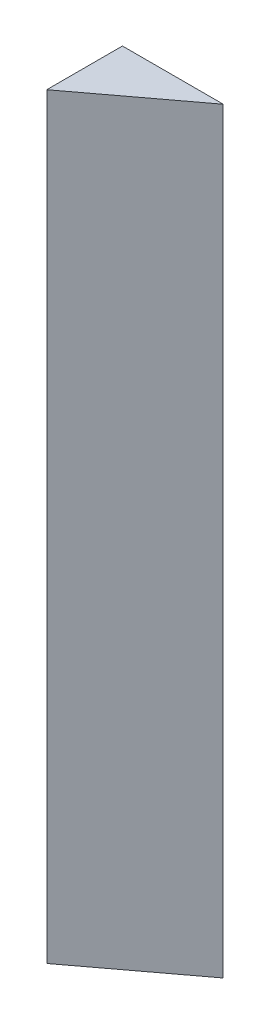
ISO-10303-21;
HEADER;
FILE_DESCRIPTION(('STEP AP214'),'2;1');
FILE_NAME('part.step','',(''),(''),'','','');
FILE_SCHEMA(('AUTOMOTIVE_DESIGN { 1 0 10303 214 1 1 1 1 }'));
ENDSEC;
DATA;
#1=APPLICATION_CONTEXT('core data for automotive mechanical design processes');
#2=APPLICATION_PROTOCOL_DEFINITION('international standard','automotive_design',2000,#1);
#3=PRODUCT_CONTEXT('',#1,'mechanical');
#4=PRODUCT('Part','Part','',(#3));
#5=PRODUCT_RELATED_PRODUCT_CATEGORY('part','',(#4));
#6=PRODUCT_DEFINITION_FORMATION('','',#4);
#7=PRODUCT_DEFINITION_CONTEXT('part definition',#1,'design');
#8=PRODUCT_DEFINITION('design','',#6,#7);
#9=PRODUCT_DEFINITION_SHAPE('','',#8);
#10=(LENGTH_UNIT() NAMED_UNIT(*) SI_UNIT(.MILLI.,.METRE.));
#11=(NAMED_UNIT(*) PLANE_ANGLE_UNIT() SI_UNIT($,.RADIAN.));
#12=(NAMED_UNIT(*) SI_UNIT($,.STERADIAN.) SOLID_ANGLE_UNIT());
#13=UNCERTAINTY_MEASURE_WITH_UNIT(LENGTH_MEASURE(1.E-05),#10,'distance_accuracy_value','');
#14=(GEOMETRIC_REPRESENTATION_CONTEXT(3) GLOBAL_UNCERTAINTY_ASSIGNED_CONTEXT((#13)) GLOBAL_UNIT_ASSIGNED_CONTEXT((#10,
#11,#12)) REPRESENTATION_CONTEXT('',''));
#15=CARTESIAN_POINT('',(0.,0.,0.));
#16=DIRECTION('',(0.,0.,1.));
#17=DIRECTION('',(1.,0.,0.));
#18=AXIS2_PLACEMENT_3D('',#15,#16,#17);
#19=CARTESIAN_POINT('',(-3.90666123986722,-0.749999613591785,-2.35778269529518));
#20=DIRECTION('',(-1.74845553146952E-07,-1.,-8.74227765734759E-08));
#21=DIRECTION('',(1.,-1.74845553146952E-07,0.));
#22=AXIS2_PLACEMENT_3D('',#19,#20,#21);
#23=PLANE('',#22);
#24=DIRECTION('',(0.999999999999985,-1.74845553322983E-07,0.));
#25=VECTOR('',#24,1.);
#26=CARTESIAN_POINT('',(-3.90000013113422,-0.749999615338783,-2.35112158656318));
#27=LINE('',#26,#25);
#28=CARTESIAN_POINT('',(-3.90000013113422,-0.749999615340783,-2.35112158656318));
#29=VERTEX_POINT('',#28);
#30=CARTESIAN_POINT('',(-3.76677795649022,-0.749999638634088,-2.35112158656318));
#31=VERTEX_POINT('',#30);
#32=EDGE_CURVE('E11',#29,#31,#27,.T.);
#33=ORIENTED_EDGE('',*,*,#32,.F.);
#34=DIRECTION('',(0.,8.74227767955204E-08,-0.999999999999996));
#35=VECTOR('',#34,1.);
#36=CARTESIAN_POINT('',(-3.90000013113422,-0.749999624081061,-2.25112158656318));
#37=LINE('',#36,#35);
#38=CARTESIAN_POINT('',(-3.90000013113422,-0.749999624083061,-2.25112158656318));
#39=VERTEX_POINT('',#38);
#40=EDGE_CURVE('E63',#39,#29,#37,.T.);
#41=ORIENTED_EDGE('',*,*,#40,.F.);
#42=DIRECTION('',(-0.799759704949037,8.73527640579342E-08,0.600320259811229));
#43=VECTOR('',#42,1.);
#44=CARTESIAN_POINT('',(-3.76677795649022,-0.749999638632088,-2.35112158656318));
#45=LINE('',#44,#43);
#46=EDGE_CURVE('E70',#31,#39,#45,.T.);
#47=ORIENTED_EDGE('',*,*,#46,.F.);
#48=EDGE_LOOP('',(#33,#41,#47));
#49=FACE_BOUND('',#48,.T.);
#50=ADVANCED_FACE('F17',(#49),#23,.F.);
#51=CARTESIAN_POINT('',(-3.90666141471277,-1.74999961359279,-2.35778278271795));
#52=DIRECTION('',(-1.74845553146952E-07,-1.,-8.74227765734759E-08));
#53=DIRECTION('',(1.,-1.74845553146952E-07,0.));
#54=AXIS2_PLACEMENT_3D('',#51,#52,#53);
#55=PLANE('',#54);
#56=DIRECTION('',(-0.799759704949038,8.73527647244234E-08,0.600320259811227));
#57=VECTOR('',#56,1.);
#58=CARTESIAN_POINT('',(-3.76677813133577,-1.74999963863309,-2.35112167398595));
#59=LINE('',#58,#57);
#60=CARTESIAN_POINT('',(-3.76677813133577,-1.74999963863209,-2.35112167398595));
#61=VERTEX_POINT('',#60);
#62=CARTESIAN_POINT('',(-3.90000030597977,-1.74999962408106,-2.25112167398595));
#63=VERTEX_POINT('',#62);
#64=EDGE_CURVE('E24',#61,#63,#59,.T.);
#65=ORIENTED_EDGE('',*,*,#64,.T.);
#66=DIRECTION('',(0.,8.7422775685297E-08,-0.999999999999996));
#67=VECTOR('',#66,1.);
#68=CARTESIAN_POINT('',(-3.90000030597977,-1.74999962408206,-2.25112167398595));
#69=LINE('',#68,#67);
#70=CARTESIAN_POINT('',(-3.90000030597977,-1.74999961533878,-2.35112167398595));
#71=VERTEX_POINT('',#70);
#72=EDGE_CURVE('E49',#63,#71,#69,.T.);
#73=ORIENTED_EDGE('',*,*,#72,.T.);
#74=DIRECTION('',(0.999999999999985,-1.74845553322982E-07,0.));
#75=VECTOR('',#74,1.);
#76=CARTESIAN_POINT('',(-3.90000030597977,-1.74999961533978,-2.35112167398595));
#77=LINE('',#76,#75);
#78=EDGE_CURVE('E46',#71,#61,#77,.T.);
#79=ORIENTED_EDGE('',*,*,#78,.T.);
#80=EDGE_LOOP('',(#65,#73,#79));
#81=FACE_BOUND('',#80,.T.);
#82=ADVANCED_FACE('F47',(#81),#55,.T.);
#83=CARTESIAN_POINT('',(-3.76677795649022,-0.749999638632088,-2.35112158656318));
#84=DIRECTION('',(0.600320259811223,-1.74880541890246E-07,0.799759704949038));
#85=DIRECTION('',(-0.799759704949047,8.73527640504488E-08,0.600320259811235));
#86=AXIS2_PLACEMENT_3D('',#83,#84,#85);
#87=PLANE('',#86);
#88=ORIENTED_EDGE('',*,*,#46,.T.);
#89=DIRECTION('',(-1.74845553146774E-07,-0.999999999999981,-8.74227765733868E-08));
#90=VECTOR('',#89,1.);
#91=CARTESIAN_POINT('',(-3.90000013113422,-0.749999624081061,-2.25112158656318));
#92=LINE('',#91,#90);
#93=EDGE_CURVE('E54',#39,#63,#92,.T.);
#94=ORIENTED_EDGE('',*,*,#93,.T.);
#95=ORIENTED_EDGE('',*,*,#64,.F.);
#96=DIRECTION('',(-1.74845553146774E-07,-0.999999999999981,-8.74227765733868E-08));
#97=VECTOR('',#96,1.);
#98=CARTESIAN_POINT('',(-3.76677795649022,-0.749999638632088,-2.35112158656318));
#99=LINE('',#98,#97);
#100=EDGE_CURVE('E61',#31,#61,#99,.T.);
#101=ORIENTED_EDGE('',*,*,#100,.F.);
#102=EDGE_LOOP('',(#88,#94,#95,#101));
#103=FACE_BOUND('',#102,.T.);
#104=ADVANCED_FACE('F60',(#103),#87,.T.);
#105=CARTESIAN_POINT('',(-3.90000013113422,-0.749999624081061,-2.25112158656318));
#106=DIRECTION('',(-1.,1.74845553146952E-07,0.));
#107=DIRECTION('',(0.,8.74227765734759E-08,-1.));
#108=AXIS2_PLACEMENT_3D('',#105,#106,#107);
#109=PLANE('',#108);
#110=ORIENTED_EDGE('',*,*,#40,.T.);
#111=DIRECTION('',(-1.74845553146774E-07,-0.999999999999981,-8.74227765733868E-08));
#112=VECTOR('',#111,1.);
#113=CARTESIAN_POINT('',(-3.90000013113422,-0.749999615338783,-2.35112158656318));
#114=LINE('',#113,#112);
#115=EDGE_CURVE('E55',#29,#71,#114,.T.);
#116=ORIENTED_EDGE('',*,*,#115,.T.);
#117=ORIENTED_EDGE('',*,*,#72,.F.);
#118=ORIENTED_EDGE('',*,*,#93,.F.);
#119=EDGE_LOOP('',(#110,#116,#117,#118));
#120=FACE_BOUND('',#119,.T.);
#121=ADVANCED_FACE('F73',(#120),#109,.T.);
#122=CARTESIAN_POINT('',(-3.90000013113422,-0.749999615338783,-2.35112158656318));
#123=DIRECTION('',(0.,8.74227765734759E-08,-1.));
#124=DIRECTION('',(1.,-1.74845553146952E-07,0.));
#125=AXIS2_PLACEMENT_3D('',#122,#123,#124);
#126=PLANE('',#125);
#127=ORIENTED_EDGE('',*,*,#32,.T.);
#128=ORIENTED_EDGE('',*,*,#100,.T.);
#129=ORIENTED_EDGE('',*,*,#78,.F.);
#130=ORIENTED_EDGE('',*,*,#115,.F.);
#131=EDGE_LOOP('',(#127,#128,#129,#130));
#132=FACE_BOUND('',#131,.T.);
#133=ADVANCED_FACE('F64',(#132),#126,.T.);
#134=CLOSED_SHELL('',(#50,#82,#104,#121,#133));
#135=MANIFOLD_SOLID_BREP('B1',#134);
#136=ADVANCED_BREP_SHAPE_REPRESENTATION('',(#18,#135),#14);
#137=SHAPE_DEFINITION_REPRESENTATION(#9,#136);
ENDSEC;
END-ISO-10303-21;
